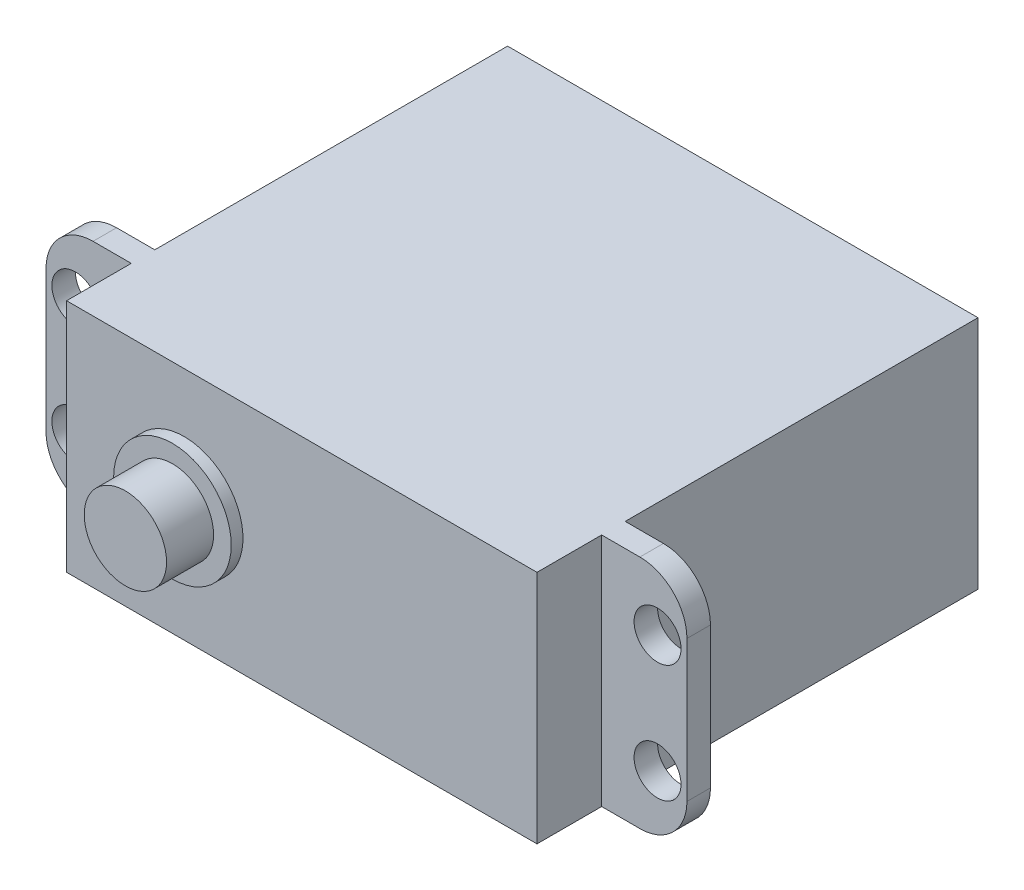
ISO-10303-21;
HEADER;
FILE_DESCRIPTION(('STEP AP214'),'2;1');
FILE_NAME('part.step','',(''),(''),'','','');
FILE_SCHEMA(('AUTOMOTIVE_DESIGN { 1 0 10303 214 1 1 1 1 }'));
ENDSEC;
DATA;
#1=APPLICATION_CONTEXT('core data for automotive mechanical design processes');
#2=APPLICATION_PROTOCOL_DEFINITION('international standard','automotive_design',2000,#1);
#3=PRODUCT_CONTEXT('',#1,'mechanical');
#4=PRODUCT('Part','Part','',(#3));
#5=PRODUCT_RELATED_PRODUCT_CATEGORY('part','',(#4));
#6=PRODUCT_DEFINITION_FORMATION('','',#4);
#7=PRODUCT_DEFINITION_CONTEXT('part definition',#1,'design');
#8=PRODUCT_DEFINITION('design','',#6,#7);
#9=PRODUCT_DEFINITION_SHAPE('','',#8);
#10=(LENGTH_UNIT() NAMED_UNIT(*) SI_UNIT(.MILLI.,.METRE.));
#11=(NAMED_UNIT(*) PLANE_ANGLE_UNIT() SI_UNIT($,.RADIAN.));
#12=(NAMED_UNIT(*) SI_UNIT($,.STERADIAN.) SOLID_ANGLE_UNIT());
#13=UNCERTAINTY_MEASURE_WITH_UNIT(LENGTH_MEASURE(1.E-05),#10,'distance_accuracy_value','');
#14=(GEOMETRIC_REPRESENTATION_CONTEXT(3) GLOBAL_UNCERTAINTY_ASSIGNED_CONTEXT((#13)) GLOBAL_UNIT_ASSIGNED_CONTEXT((#10,
#11,#12)) REPRESENTATION_CONTEXT('',''));
#15=CARTESIAN_POINT('',(0.,0.,0.));
#16=DIRECTION('',(0.,0.,1.));
#17=DIRECTION('',(1.,0.,0.));
#18=AXIS2_PLACEMENT_3D('',#15,#16,#17);
#19=CARTESIAN_POINT('',(-20.,-10.,37.5));
#20=DIRECTION('',(-1.,0.,0.));
#21=DIRECTION('',(0.,0.,1.));
#22=AXIS2_PLACEMENT_3D('',#19,#20,#21);
#23=PLANE('',#22);
#24=DIRECTION('',(0.,-1.,0.));
#25=VECTOR('',#24,1.);
#26=CARTESIAN_POINT('',(-20.,10.,30.));
#27=LINE('',#26,#25);
#28=CARTESIAN_POINT('',(-20.,10.,30.));
#29=VERTEX_POINT('',#28);
#30=CARTESIAN_POINT('',(-20.,-10.,30.));
#31=VERTEX_POINT('',#30);
#32=EDGE_CURVE('E190',#29,#31,#27,.T.);
#33=ORIENTED_EDGE('',*,*,#32,.F.);
#34=DIRECTION('',(0.,0.,-1.));
#35=VECTOR('',#34,1.);
#36=CARTESIAN_POINT('',(-20.,10.,37.5));
#37=LINE('',#36,#35);
#38=CARTESIAN_POINT('',(-20.,10.,0.));
#39=VERTEX_POINT('',#38);
#40=EDGE_CURVE('E185',#29,#39,#37,.T.);
#41=ORIENTED_EDGE('',*,*,#40,.T.);
#42=DIRECTION('',(0.,1.,0.));
#43=VECTOR('',#42,1.);
#44=CARTESIAN_POINT('',(-20.,-10.,0.));
#45=LINE('',#44,#43);
#46=CARTESIAN_POINT('',(-20.,-10.,0.));
#47=VERTEX_POINT('',#46);
#48=EDGE_CURVE('E248',#47,#39,#45,.T.);
#49=ORIENTED_EDGE('',*,*,#48,.F.);
#50=DIRECTION('',(0.,0.,-1.));
#51=VECTOR('',#50,1.);
#52=CARTESIAN_POINT('',(-20.,-10.,37.5));
#53=LINE('',#52,#51);
#54=EDGE_CURVE('E287',#31,#47,#53,.T.);
#55=ORIENTED_EDGE('',*,*,#54,.F.);
#56=EDGE_LOOP('',(#33,#41,#49,#55));
#57=FACE_BOUND('',#56,.T.);
#58=ADVANCED_FACE('F45',(#57),#23,.T.);
#59=CARTESIAN_POINT('',(20.,-10.,37.5));
#60=DIRECTION('',(-1.,0.,0.));
#61=DIRECTION('',(0.,0.,1.));
#62=AXIS2_PLACEMENT_3D('',#59,#60,#61);
#63=PLANE('',#62);
#64=DIRECTION('',(0.,0.,-1.));
#65=VECTOR('',#64,1.);
#66=CARTESIAN_POINT('',(20.,-10.,37.5));
#67=LINE('',#66,#65);
#68=CARTESIAN_POINT('',(20.,-10.,37.5));
#69=VERTEX_POINT('',#68);
#70=CARTESIAN_POINT('',(20.,-10.,32.));
#71=VERTEX_POINT('',#70);
#72=EDGE_CURVE('E288',#69,#71,#67,.T.);
#73=ORIENTED_EDGE('',*,*,#72,.T.);
#74=DIRECTION('',(0.,1.,0.));
#75=VECTOR('',#74,1.);
#76=CARTESIAN_POINT('',(20.,-10.,32.));
#77=LINE('',#76,#75);
#78=CARTESIAN_POINT('',(20.,10.,32.));
#79=VERTEX_POINT('',#78);
#80=EDGE_CURVE('E217',#71,#79,#77,.T.);
#81=ORIENTED_EDGE('',*,*,#80,.T.);
#82=DIRECTION('',(0.,0.,-1.));
#83=VECTOR('',#82,1.);
#84=CARTESIAN_POINT('',(20.,10.,37.5));
#85=LINE('',#84,#83);
#86=CARTESIAN_POINT('',(20.,10.,37.5));
#87=VERTEX_POINT('',#86);
#88=EDGE_CURVE('E293',#87,#79,#85,.T.);
#89=ORIENTED_EDGE('',*,*,#88,.F.);
#90=DIRECTION('',(0.,1.,0.));
#91=VECTOR('',#90,1.);
#92=CARTESIAN_POINT('',(20.,-10.,37.5));
#93=LINE('',#92,#91);
#94=EDGE_CURVE('E263',#69,#87,#93,.T.);
#95=ORIENTED_EDGE('',*,*,#94,.F.);
#96=EDGE_LOOP('',(#73,#81,#89,#95));
#97=FACE_BOUND('',#96,.T.);
#98=ADVANCED_FACE('F361',(#97),#63,.F.);
#99=DIRECTION('',(0.,1.,0.));
#100=VECTOR('',#99,1.);
#101=CARTESIAN_POINT('',(-20.,-10.,32.));
#102=LINE('',#101,#100);
#103=CARTESIAN_POINT('',(-20.,-10.,32.));
#104=VERTEX_POINT('',#103);
#105=CARTESIAN_POINT('',(-20.,10.,32.));
#106=VERTEX_POINT('',#105);
#107=EDGE_CURVE('E179',#104,#106,#102,.T.);
#108=ORIENTED_EDGE('',*,*,#107,.F.);
#109=CARTESIAN_POINT('',(-20.,-10.,37.5));
#110=VERTEX_POINT('',#109);
#111=EDGE_CURVE('E283',#110,#104,#53,.T.);
#112=ORIENTED_EDGE('',*,*,#111,.F.);
#113=DIRECTION('',(0.,1.,0.));
#114=VECTOR('',#113,1.);
#115=CARTESIAN_POINT('',(-20.,-10.,37.5));
#116=LINE('',#115,#114);
#117=CARTESIAN_POINT('',(-20.,10.,37.5));
#118=VERTEX_POINT('',#117);
#119=EDGE_CURVE('E182',#110,#118,#116,.T.);
#120=ORIENTED_EDGE('',*,*,#119,.T.);
#121=EDGE_CURVE('E164',#118,#106,#37,.T.);
#122=ORIENTED_EDGE('',*,*,#121,.T.);
#123=EDGE_LOOP('',(#108,#112,#120,#122));
#124=FACE_BOUND('',#123,.T.);
#125=ADVANCED_FACE('F178',(#124),#23,.T.);
#126=CARTESIAN_POINT('',(-20.,-10.,37.5));
#127=DIRECTION('',(0.,1.,0.));
#128=DIRECTION('',(0.,0.,1.));
#129=AXIS2_PLACEMENT_3D('',#126,#127,#128);
#130=PLANE('',#129);
#131=DIRECTION('',(1.,0.,0.));
#132=VECTOR('',#131,1.);
#133=CARTESIAN_POINT('',(-27.25,-10.,32.));
#134=LINE('',#133,#132);
#135=CARTESIAN_POINT('',(-23.25,-10.,32.));
#136=VERTEX_POINT('',#135);
#137=EDGE_CURVE('E172',#136,#104,#134,.T.);
#138=ORIENTED_EDGE('',*,*,#137,.F.);
#139=DIRECTION('',(0.,0.,1.));
#140=VECTOR('',#139,1.);
#141=CARTESIAN_POINT('',(-23.25,-10.,30.));
#142=LINE('',#141,#140);
#143=CARTESIAN_POINT('',(-23.25,-10.,30.));
#144=VERTEX_POINT('',#143);
#145=EDGE_CURVE('E70',#136,#144,#142,.F.);
#146=ORIENTED_EDGE('',*,*,#145,.T.);
#147=DIRECTION('',(1.,0.,0.));
#148=VECTOR('',#147,1.);
#149=CARTESIAN_POINT('',(-27.25,-10.,30.));
#150=LINE('',#149,#148);
#151=EDGE_CURVE('E205',#144,#31,#150,.T.);
#152=ORIENTED_EDGE('',*,*,#151,.T.);
#153=ORIENTED_EDGE('',*,*,#54,.T.);
#154=DIRECTION('',(1.,0.,0.));
#155=VECTOR('',#154,1.);
#156=CARTESIAN_POINT('',(-20.,-10.,0.));
#157=LINE('',#156,#155);
#158=CARTESIAN_POINT('',(20.,-10.,0.));
#159=VERTEX_POINT('',#158);
#160=EDGE_CURVE('E260',#47,#159,#157,.T.);
#161=ORIENTED_EDGE('',*,*,#160,.T.);
#162=CARTESIAN_POINT('',(20.,-10.,30.));
#163=VERTEX_POINT('',#162);
#164=EDGE_CURVE('E292',#163,#159,#67,.T.);
#165=ORIENTED_EDGE('',*,*,#164,.F.);
#166=DIRECTION('',(-1.,0.,0.));
#167=VECTOR('',#166,1.);
#168=CARTESIAN_POINT('',(27.25,-10.,30.));
#169=LINE('',#168,#167);
#170=CARTESIAN_POINT('',(23.25,-10.,30.));
#171=VERTEX_POINT('',#170);
#172=EDGE_CURVE('E245',#171,#163,#169,.T.);
#173=ORIENTED_EDGE('',*,*,#172,.F.);
#174=DIRECTION('',(0.,0.,1.));
#175=VECTOR('',#174,1.);
#176=CARTESIAN_POINT('',(23.25,-10.,37.5));
#177=LINE('',#176,#175);
#178=CARTESIAN_POINT('',(23.25,-10.,32.));
#179=VERTEX_POINT('',#178);
#180=EDGE_CURVE('E318',#171,#179,#177,.T.);
#181=ORIENTED_EDGE('',*,*,#180,.T.);
#182=DIRECTION('',(-1.,0.,0.));
#183=VECTOR('',#182,1.);
#184=CARTESIAN_POINT('',(27.25,-10.,32.));
#185=LINE('',#184,#183);
#186=EDGE_CURVE('E238',#179,#71,#185,.T.);
#187=ORIENTED_EDGE('',*,*,#186,.T.);
#188=ORIENTED_EDGE('',*,*,#72,.F.);
#189=DIRECTION('',(1.,0.,0.));
#190=VECTOR('',#189,1.);
#191=CARTESIAN_POINT('',(-20.,-10.,37.5));
#192=LINE('',#191,#190);
#193=EDGE_CURVE('E266',#110,#69,#192,.T.);
#194=ORIENTED_EDGE('',*,*,#193,.F.);
#195=ORIENTED_EDGE('',*,*,#111,.T.);
#196=EDGE_LOOP('',(#138,#146,#152,#153,#161,#165,#173,#181,#187,#188,#194,#195));
#197=FACE_BOUND('',#196,.T.);
#198=ADVANCED_FACE('F447',(#197),#130,.F.);
#199=CARTESIAN_POINT('',(20.,10.,30.));
#200=VERTEX_POINT('',#199);
#201=CARTESIAN_POINT('',(20.,10.,0.));
#202=VERTEX_POINT('',#201);
#203=EDGE_CURVE('E184',#200,#202,#85,.T.);
#204=ORIENTED_EDGE('',*,*,#203,.F.);
#205=DIRECTION('',(0.,-1.,0.));
#206=VECTOR('',#205,1.);
#207=CARTESIAN_POINT('',(20.,10.,30.));
#208=LINE('',#207,#206);
#209=EDGE_CURVE('E234',#200,#163,#208,.T.);
#210=ORIENTED_EDGE('',*,*,#209,.T.);
#211=ORIENTED_EDGE('',*,*,#164,.T.);
#212=DIRECTION('',(0.,1.,0.));
#213=VECTOR('',#212,1.);
#214=CARTESIAN_POINT('',(20.,-10.,0.));
#215=LINE('',#214,#213);
#216=EDGE_CURVE('E276',#159,#202,#215,.T.);
#217=ORIENTED_EDGE('',*,*,#216,.T.);
#218=EDGE_LOOP('',(#204,#210,#211,#217));
#219=FACE_BOUND('',#218,.T.);
#220=ADVANCED_FACE('F380',(#219),#63,.F.);
#221=CARTESIAN_POINT('',(-20.,10.,37.5));
#222=DIRECTION('',(0.,1.,0.));
#223=DIRECTION('',(0.,0.,1.));
#224=AXIS2_PLACEMENT_3D('',#221,#222,#223);
#225=PLANE('',#224);
#226=DIRECTION('',(1.,0.,0.));
#227=VECTOR('',#226,1.);
#228=CARTESIAN_POINT('',(-27.25,10.,30.));
#229=LINE('',#228,#227);
#230=CARTESIAN_POINT('',(-23.25,10.,30.));
#231=VERTEX_POINT('',#230);
#232=EDGE_CURVE('E173',#231,#29,#229,.T.);
#233=ORIENTED_EDGE('',*,*,#232,.F.);
#234=DIRECTION('',(0.,0.,-1.));
#235=VECTOR('',#234,1.);
#236=CARTESIAN_POINT('',(-23.25,10.,37.5));
#237=LINE('',#236,#235);
#238=CARTESIAN_POINT('',(-23.25,10.,32.));
#239=VERTEX_POINT('',#238);
#240=EDGE_CURVE('E167',#231,#239,#237,.F.);
#241=ORIENTED_EDGE('',*,*,#240,.T.);
#242=DIRECTION('',(1.,0.,0.));
#243=VECTOR('',#242,1.);
#244=CARTESIAN_POINT('',(-27.25,10.,32.));
#245=LINE('',#244,#243);
#246=EDGE_CURVE('E160',#239,#106,#245,.T.);
#247=ORIENTED_EDGE('',*,*,#246,.T.);
#248=ORIENTED_EDGE('',*,*,#121,.F.);
#249=DIRECTION('',(1.,0.,0.));
#250=VECTOR('',#249,1.);
#251=CARTESIAN_POINT('',(-20.,10.,37.5));
#252=LINE('',#251,#250);
#253=EDGE_CURVE('E259',#118,#87,#252,.T.);
#254=ORIENTED_EDGE('',*,*,#253,.T.);
#255=ORIENTED_EDGE('',*,*,#88,.T.);
#256=DIRECTION('',(-1.,0.,0.));
#257=VECTOR('',#256,1.);
#258=CARTESIAN_POINT('',(27.25,10.,32.));
#259=LINE('',#258,#257);
#260=CARTESIAN_POINT('',(23.25,10.,32.));
#261=VERTEX_POINT('',#260);
#262=EDGE_CURVE('E252',#261,#79,#259,.T.);
#263=ORIENTED_EDGE('',*,*,#262,.F.);
#264=DIRECTION('',(0.,0.,-1.));
#265=VECTOR('',#264,1.);
#266=CARTESIAN_POINT('',(23.25,10.,30.));
#267=LINE('',#266,#265);
#268=CARTESIAN_POINT('',(23.25,10.,30.));
#269=VERTEX_POINT('',#268);
#270=EDGE_CURVE('E286',#261,#269,#267,.T.);
#271=ORIENTED_EDGE('',*,*,#270,.T.);
#272=DIRECTION('',(-1.,0.,0.));
#273=VECTOR('',#272,1.);
#274=CARTESIAN_POINT('',(27.25,10.,30.));
#275=LINE('',#274,#273);
#276=EDGE_CURVE('E249',#269,#200,#275,.T.);
#277=ORIENTED_EDGE('',*,*,#276,.T.);
#278=ORIENTED_EDGE('',*,*,#203,.T.);
#279=DIRECTION('',(1.,0.,0.));
#280=VECTOR('',#279,1.);
#281=CARTESIAN_POINT('',(-20.,10.,0.));
#282=LINE('',#281,#280);
#283=EDGE_CURVE('E272',#39,#202,#282,.T.);
#284=ORIENTED_EDGE('',*,*,#283,.F.);
#285=ORIENTED_EDGE('',*,*,#40,.F.);
#286=EDGE_LOOP('',(#233,#241,#247,#248,#254,#255,#263,#271,#277,#278,#284,#285));
#287=FACE_BOUND('',#286,.T.);
#288=ADVANCED_FACE('F162',(#287),#225,.T.);
#289=CARTESIAN_POINT('',(0.,0.,37.5));
#290=DIRECTION('',(0.,0.,-1.));
#291=DIRECTION('',(-1.,0.,0.));
#292=AXIS2_PLACEMENT_3D('',#289,#290,#291);
#293=PLANE('',#292);
#294=CARTESIAN_POINT('',(-10.,0.,37.5));
#295=DIRECTION('',(0.,0.,-1.));
#296=DIRECTION('',(-1.,0.,0.));
#297=AXIS2_PLACEMENT_3D('',#294,#295,#296);
#298=CIRCLE('',#297,5.);
#299=CARTESIAN_POINT('',(-15.,0.,37.5));
#300=VERTEX_POINT('',#299);
#301=EDGE_CURVE('E49',#300,#300,#298,.F.);
#302=ORIENTED_EDGE('',*,*,#301,.F.);
#303=EDGE_LOOP('',(#302));
#304=FACE_BOUND('',#303,.T.);
#305=ORIENTED_EDGE('',*,*,#119,.F.);
#306=ORIENTED_EDGE('',*,*,#193,.T.);
#307=ORIENTED_EDGE('',*,*,#94,.T.);
#308=ORIENTED_EDGE('',*,*,#253,.F.);
#309=EDGE_LOOP('',(#305,#306,#307,#308));
#310=FACE_BOUND('',#309,.T.);
#311=ADVANCED_FACE('F349',(#304,#310),#293,.F.);
#312=CARTESIAN_POINT('',(0.,0.,0.));
#313=DIRECTION('',(0.,0.,-1.));
#314=DIRECTION('',(-1.,0.,0.));
#315=AXIS2_PLACEMENT_3D('',#312,#313,#314);
#316=PLANE('',#315);
#317=ORIENTED_EDGE('',*,*,#48,.T.);
#318=ORIENTED_EDGE('',*,*,#283,.T.);
#319=ORIENTED_EDGE('',*,*,#216,.F.);
#320=ORIENTED_EDGE('',*,*,#160,.F.);
#321=EDGE_LOOP('',(#317,#318,#319,#320));
#322=FACE_BOUND('',#321,.T.);
#323=ADVANCED_FACE('F352',(#322),#316,.T.);
#324=CARTESIAN_POINT('',(27.25,10.,30.));
#325=DIRECTION('',(0.,0.,-1.));
#326=DIRECTION('',(0.,1.,0.));
#327=AXIS2_PLACEMENT_3D('',#324,#325,#326);
#328=PLANE('',#327);
#329=CARTESIAN_POINT('',(24.75,4.99942998703595,30.));
#330=DIRECTION('',(0.,0.,1.));
#331=DIRECTION('',(1.,0.,0.));
#332=AXIS2_PLACEMENT_3D('',#329,#330,#331);
#333=CIRCLE('',#332,1.99547319519888);
#334=CARTESIAN_POINT('',(26.7454731951989,4.99942998703595,30.));
#335=VERTEX_POINT('',#334);
#336=EDGE_CURVE('E213',#335,#335,#333,.T.);
#337=ORIENTED_EDGE('',*,*,#336,.T.);
#338=EDGE_LOOP('',(#337));
#339=FACE_BOUND('',#338,.T.);
#340=CARTESIAN_POINT('',(24.75,-4.99913934048573,30.));
#341=DIRECTION('',(0.,0.,1.));
#342=DIRECTION('',(1.,0.,0.));
#343=AXIS2_PLACEMENT_3D('',#340,#341,#342);
#344=CIRCLE('',#343,1.99547319519888);
#345=CARTESIAN_POINT('',(26.7454731951989,-4.99913934048573,30.));
#346=VERTEX_POINT('',#345);
#347=EDGE_CURVE('E212',#346,#346,#344,.T.);
#348=ORIENTED_EDGE('',*,*,#347,.T.);
#349=EDGE_LOOP('',(#348));
#350=FACE_BOUND('',#349,.T.);
#351=ORIENTED_EDGE('',*,*,#276,.F.);
#352=CARTESIAN_POINT('',(23.25,6.,30.));
#353=DIRECTION('',(0.,0.,-1.));
#354=DIRECTION('',(0.,1.,0.));
#355=AXIS2_PLACEMENT_3D('',#352,#353,#354);
#356=CIRCLE('',#355,4.);
#357=CARTESIAN_POINT('',(27.25,6.,30.));
#358=VERTEX_POINT('',#357);
#359=EDGE_CURVE('E303',#269,#358,#356,.T.);
#360=ORIENTED_EDGE('',*,*,#359,.T.);
#361=DIRECTION('',(0.,-1.,0.));
#362=VECTOR('',#361,1.);
#363=CARTESIAN_POINT('',(27.25,10.,30.));
#364=LINE('',#363,#362);
#365=CARTESIAN_POINT('',(27.25,-6.,30.));
#366=VERTEX_POINT('',#365);
#367=EDGE_CURVE('E233',#358,#366,#364,.T.);
#368=ORIENTED_EDGE('',*,*,#367,.T.);
#369=CARTESIAN_POINT('',(23.25,-6.,30.));
#370=DIRECTION('',(0.,0.,-1.));
#371=DIRECTION('',(0.,1.,0.));
#372=AXIS2_PLACEMENT_3D('',#369,#370,#371);
#373=CIRCLE('',#372,4.);
#374=EDGE_CURVE('E300',#366,#171,#373,.T.);
#375=ORIENTED_EDGE('',*,*,#374,.T.);
#376=ORIENTED_EDGE('',*,*,#172,.T.);
#377=ORIENTED_EDGE('',*,*,#209,.F.);
#378=EDGE_LOOP('',(#351,#360,#368,#375,#376,#377));
#379=FACE_BOUND('',#378,.T.);
#380=ADVANCED_FACE('F374',(#339,#350,#379),#328,.T.);
#381=CARTESIAN_POINT('',(27.25,-10.,32.));
#382=DIRECTION('',(0.,0.,1.));
#383=DIRECTION('',(1.,0.,0.));
#384=AXIS2_PLACEMENT_3D('',#381,#382,#383);
#385=PLANE('',#384);
#386=CARTESIAN_POINT('',(24.75,4.99942998703595,32.));
#387=DIRECTION('',(0.,0.,1.));
#388=DIRECTION('',(1.,0.,0.));
#389=AXIS2_PLACEMENT_3D('',#386,#387,#388);
#390=CIRCLE('',#389,1.99547319519888);
#391=CARTESIAN_POINT('',(26.7454731951989,4.99942998703595,32.));
#392=VERTEX_POINT('',#391);
#393=EDGE_CURVE('E218',#392,#392,#390,.T.);
#394=ORIENTED_EDGE('',*,*,#393,.F.);
#395=EDGE_LOOP('',(#394));
#396=FACE_BOUND('',#395,.T.);
#397=CARTESIAN_POINT('',(24.75,-4.99913934048573,32.));
#398=DIRECTION('',(0.,0.,1.));
#399=DIRECTION('',(1.,0.,0.));
#400=AXIS2_PLACEMENT_3D('',#397,#398,#399);
#401=CIRCLE('',#400,1.99547319519888);
#402=CARTESIAN_POINT('',(26.7454731951989,-4.99913934048573,32.));
#403=VERTEX_POINT('',#402);
#404=EDGE_CURVE('E222',#403,#403,#401,.T.);
#405=ORIENTED_EDGE('',*,*,#404,.F.);
#406=EDGE_LOOP('',(#405));
#407=FACE_BOUND('',#406,.T.);
#408=DIRECTION('',(0.,1.,0.));
#409=VECTOR('',#408,1.);
#410=CARTESIAN_POINT('',(27.25,-10.,32.));
#411=LINE('',#410,#409);
#412=CARTESIAN_POINT('',(27.25,-6.,32.));
#413=VERTEX_POINT('',#412);
#414=CARTESIAN_POINT('',(27.25,6.,32.));
#415=VERTEX_POINT('',#414);
#416=EDGE_CURVE('E229',#413,#415,#411,.T.);
#417=ORIENTED_EDGE('',*,*,#416,.T.);
#418=CARTESIAN_POINT('',(23.25,6.,32.));
#419=DIRECTION('',(0.,0.,1.));
#420=DIRECTION('',(1.,0.,0.));
#421=AXIS2_PLACEMENT_3D('',#418,#419,#420);
#422=CIRCLE('',#421,4.);
#423=EDGE_CURVE('E315',#415,#261,#422,.T.);
#424=ORIENTED_EDGE('',*,*,#423,.T.);
#425=ORIENTED_EDGE('',*,*,#262,.T.);
#426=ORIENTED_EDGE('',*,*,#80,.F.);
#427=ORIENTED_EDGE('',*,*,#186,.F.);
#428=CARTESIAN_POINT('',(23.25,-6.,32.));
#429=DIRECTION('',(0.,0.,1.));
#430=DIRECTION('',(1.,0.,0.));
#431=AXIS2_PLACEMENT_3D('',#428,#429,#430);
#432=CIRCLE('',#431,4.);
#433=EDGE_CURVE('E312',#179,#413,#432,.T.);
#434=ORIENTED_EDGE('',*,*,#433,.T.);
#435=EDGE_LOOP('',(#417,#424,#425,#426,#427,#434));
#436=FACE_BOUND('',#435,.T.);
#437=ADVANCED_FACE('F365',(#396,#407,#436),#385,.T.);
#438=CARTESIAN_POINT('',(27.25,0.,0.));
#439=DIRECTION('',(-1.,0.,0.));
#440=DIRECTION('',(0.,0.,1.));
#441=AXIS2_PLACEMENT_3D('',#438,#439,#440);
#442=PLANE('',#441);
#443=ORIENTED_EDGE('',*,*,#367,.F.);
#444=DIRECTION('',(0.,0.,-1.));
#445=VECTOR('',#444,1.);
#446=CARTESIAN_POINT('',(27.25,6.,32.));
#447=LINE('',#446,#445);
#448=EDGE_CURVE('E309',#358,#415,#447,.F.);
#449=ORIENTED_EDGE('',*,*,#448,.T.);
#450=ORIENTED_EDGE('',*,*,#416,.F.);
#451=DIRECTION('',(0.,0.,1.));
#452=VECTOR('',#451,1.);
#453=CARTESIAN_POINT('',(27.25,-6.,0.));
#454=LINE('',#453,#452);
#455=EDGE_CURVE('E306',#413,#366,#454,.F.);
#456=ORIENTED_EDGE('',*,*,#455,.T.);
#457=EDGE_LOOP('',(#443,#449,#450,#456));
#458=FACE_BOUND('',#457,.T.);
#459=ADVANCED_FACE('F558',(#458),#442,.F.);
#460=CARTESIAN_POINT('',(24.75,-4.99913934048573,30.));
#461=DIRECTION('',(0.,0.,1.));
#462=DIRECTION('',(1.,0.,0.));
#463=AXIS2_PLACEMENT_3D('',#460,#461,#462);
#464=CYLINDRICAL_SURFACE('',#463,1.99547319519888);
#465=ORIENTED_EDGE('',*,*,#347,.F.);
#466=EDGE_LOOP('',(#465));
#467=FACE_BOUND('',#466,.T.);
#468=ORIENTED_EDGE('',*,*,#404,.T.);
#469=EDGE_LOOP('',(#468));
#470=FACE_BOUND('',#469,.T.);
#471=ADVANCED_FACE('F568',(#467,#470),#464,.F.);
#472=CARTESIAN_POINT('',(24.75,4.99942998703595,30.));
#473=DIRECTION('',(0.,0.,1.));
#474=DIRECTION('',(1.,0.,0.));
#475=AXIS2_PLACEMENT_3D('',#472,#473,#474);
#476=CYLINDRICAL_SURFACE('',#475,1.99547319519888);
#477=ORIENTED_EDGE('',*,*,#336,.F.);
#478=EDGE_LOOP('',(#477));
#479=FACE_BOUND('',#478,.T.);
#480=ORIENTED_EDGE('',*,*,#393,.T.);
#481=EDGE_LOOP('',(#480));
#482=FACE_BOUND('',#481,.T.);
#483=ADVANCED_FACE('F579',(#479,#482),#476,.F.);
#484=CARTESIAN_POINT('',(23.25,6.,37.5));
#485=DIRECTION('',(0.,0.,1.));
#486=DIRECTION('',(1.,0.,0.));
#487=AXIS2_PLACEMENT_3D('',#484,#485,#486);
#488=CYLINDRICAL_SURFACE('',#487,4.);
#489=ORIENTED_EDGE('',*,*,#423,.F.);
#490=ORIENTED_EDGE('',*,*,#448,.F.);
#491=ORIENTED_EDGE('',*,*,#359,.F.);
#492=ORIENTED_EDGE('',*,*,#270,.F.);
#493=EDGE_LOOP('',(#489,#490,#491,#492));
#494=FACE_BOUND('',#493,.T.);
#495=ADVANCED_FACE('F370',(#494),#488,.T.);
#496=CARTESIAN_POINT('',(23.25,-6.,37.5));
#497=DIRECTION('',(0.,0.,1.));
#498=DIRECTION('',(1.,0.,0.));
#499=AXIS2_PLACEMENT_3D('',#496,#497,#498);
#500=CYLINDRICAL_SURFACE('',#499,4.);
#501=ORIENTED_EDGE('',*,*,#374,.F.);
#502=ORIENTED_EDGE('',*,*,#455,.F.);
#503=ORIENTED_EDGE('',*,*,#433,.F.);
#504=ORIENTED_EDGE('',*,*,#180,.F.);
#505=EDGE_LOOP('',(#501,#502,#503,#504));
#506=FACE_BOUND('',#505,.T.);
#507=ADVANCED_FACE('F469',(#506),#500,.T.);
#508=CARTESIAN_POINT('',(-27.25,-10.,32.));
#509=DIRECTION('',(0.,0.,-1.));
#510=DIRECTION('',(-1.,0.,0.));
#511=AXIS2_PLACEMENT_3D('',#508,#509,#510);
#512=PLANE('',#511);
#513=CARTESIAN_POINT('',(-24.75,5.,32.));
#514=DIRECTION('',(0.,0.,1.));
#515=DIRECTION('',(1.,0.,0.));
#516=AXIS2_PLACEMENT_3D('',#513,#514,#515);
#517=CIRCLE('',#516,2.);
#518=CARTESIAN_POINT('',(-22.75,5.,32.));
#519=VERTEX_POINT('',#518);
#520=EDGE_CURVE('E199',#519,#519,#517,.T.);
#521=ORIENTED_EDGE('',*,*,#520,.F.);
#522=EDGE_LOOP('',(#521));
#523=FACE_BOUND('',#522,.T.);
#524=CARTESIAN_POINT('',(-24.75,-5.,32.));
#525=DIRECTION('',(0.,0.,1.));
#526=DIRECTION('',(1.,0.,0.));
#527=AXIS2_PLACEMENT_3D('',#524,#525,#526);
#528=CIRCLE('',#527,2.);
#529=CARTESIAN_POINT('',(-22.75,-5.,32.));
#530=VERTEX_POINT('',#529);
#531=EDGE_CURVE('E397',#530,#530,#528,.T.);
#532=ORIENTED_EDGE('',*,*,#531,.F.);
#533=EDGE_LOOP('',(#532));
#534=FACE_BOUND('',#533,.T.);
#535=DIRECTION('',(0.,1.,0.));
#536=VECTOR('',#535,1.);
#537=CARTESIAN_POINT('',(-27.25,-10.,32.));
#538=LINE('',#537,#536);
#539=CARTESIAN_POINT('',(-27.25,-6.,32.));
#540=VERTEX_POINT('',#539);
#541=CARTESIAN_POINT('',(-27.25,6.,32.));
#542=VERTEX_POINT('',#541);
#543=EDGE_CURVE('E196',#540,#542,#538,.T.);
#544=ORIENTED_EDGE('',*,*,#543,.F.);
#545=CARTESIAN_POINT('',(-23.25,-6.,32.));
#546=DIRECTION('',(0.,0.,-1.));
#547=DIRECTION('',(-1.,0.,0.));
#548=AXIS2_PLACEMENT_3D('',#545,#546,#547);
#549=CIRCLE('',#548,4.);
#550=EDGE_CURVE('E333',#540,#136,#549,.F.);
#551=ORIENTED_EDGE('',*,*,#550,.T.);
#552=ORIENTED_EDGE('',*,*,#137,.T.);
#553=ORIENTED_EDGE('',*,*,#107,.T.);
#554=ORIENTED_EDGE('',*,*,#246,.F.);
#555=CARTESIAN_POINT('',(-23.25,6.,32.));
#556=DIRECTION('',(0.,0.,-1.));
#557=DIRECTION('',(-1.,0.,0.));
#558=AXIS2_PLACEMENT_3D('',#555,#556,#557);
#559=CIRCLE('',#558,4.);
#560=EDGE_CURVE('E330',#239,#542,#559,.F.);
#561=ORIENTED_EDGE('',*,*,#560,.T.);
#562=EDGE_LOOP('',(#544,#551,#552,#553,#554,#561));
#563=FACE_BOUND('',#562,.T.);
#564=ADVANCED_FACE('F188',(#523,#534,#563),#512,.F.);
#565=CARTESIAN_POINT('',(-27.25,10.,30.));
#566=DIRECTION('',(0.,0.,1.));
#567=DIRECTION('',(0.,-1.,0.));
#568=AXIS2_PLACEMENT_3D('',#565,#566,#567);
#569=PLANE('',#568);
#570=CARTESIAN_POINT('',(-24.75,5.,30.));
#571=DIRECTION('',(0.,0.,1.));
#572=DIRECTION('',(1.,0.,0.));
#573=AXIS2_PLACEMENT_3D('',#570,#571,#572);
#574=CIRCLE('',#573,2.);
#575=CARTESIAN_POINT('',(-22.75,5.,30.));
#576=VERTEX_POINT('',#575);
#577=EDGE_CURVE('E191',#576,#576,#574,.T.);
#578=ORIENTED_EDGE('',*,*,#577,.T.);
#579=EDGE_LOOP('',(#578));
#580=FACE_BOUND('',#579,.T.);
#581=CARTESIAN_POINT('',(-24.75,-5.,30.));
#582=DIRECTION('',(0.,0.,1.));
#583=DIRECTION('',(1.,0.,0.));
#584=AXIS2_PLACEMENT_3D('',#581,#582,#583);
#585=CIRCLE('',#584,2.);
#586=CARTESIAN_POINT('',(-22.75,-5.,30.));
#587=VERTEX_POINT('',#586);
#588=EDGE_CURVE('E393',#587,#587,#585,.T.);
#589=ORIENTED_EDGE('',*,*,#588,.T.);
#590=EDGE_LOOP('',(#589));
#591=FACE_BOUND('',#590,.T.);
#592=ORIENTED_EDGE('',*,*,#151,.F.);
#593=CARTESIAN_POINT('',(-23.25,-6.,30.));
#594=DIRECTION('',(0.,0.,1.));
#595=DIRECTION('',(0.,-1.,0.));
#596=AXIS2_PLACEMENT_3D('',#593,#594,#595);
#597=CIRCLE('',#596,4.);
#598=CARTESIAN_POINT('',(-27.25,-6.,30.));
#599=VERTEX_POINT('',#598);
#600=EDGE_CURVE('E340',#144,#599,#597,.F.);
#601=ORIENTED_EDGE('',*,*,#600,.T.);
#602=DIRECTION('',(0.,-1.,0.));
#603=VECTOR('',#602,1.);
#604=CARTESIAN_POINT('',(-27.25,10.,30.));
#605=LINE('',#604,#603);
#606=CARTESIAN_POINT('',(-27.25,6.,30.));
#607=VERTEX_POINT('',#606);
#608=EDGE_CURVE('E202',#607,#599,#605,.T.);
#609=ORIENTED_EDGE('',*,*,#608,.F.);
#610=CARTESIAN_POINT('',(-23.25,6.,30.));
#611=DIRECTION('',(0.,0.,1.));
#612=DIRECTION('',(0.,-1.,0.));
#613=AXIS2_PLACEMENT_3D('',#610,#611,#612);
#614=CIRCLE('',#613,4.);
#615=EDGE_CURVE('E62',#607,#231,#614,.F.);
#616=ORIENTED_EDGE('',*,*,#615,.T.);
#617=ORIENTED_EDGE('',*,*,#232,.T.);
#618=ORIENTED_EDGE('',*,*,#32,.T.);
#619=EDGE_LOOP('',(#592,#601,#609,#616,#617,#618));
#620=FACE_BOUND('',#619,.T.);
#621=ADVANCED_FACE('F468',(#580,#591,#620),#569,.F.);
#622=CARTESIAN_POINT('',(-27.25,0.,0.));
#623=DIRECTION('',(-1.,0.,0.));
#624=DIRECTION('',(0.,0.,1.));
#625=AXIS2_PLACEMENT_3D('',#622,#623,#624);
#626=PLANE('',#625);
#627=ORIENTED_EDGE('',*,*,#608,.T.);
#628=DIRECTION('',(0.,0.,1.));
#629=VECTOR('',#628,1.);
#630=CARTESIAN_POINT('',(-27.25,-6.,32.));
#631=LINE('',#630,#629);
#632=EDGE_CURVE('E326',#599,#540,#631,.T.);
#633=ORIENTED_EDGE('',*,*,#632,.T.);
#634=ORIENTED_EDGE('',*,*,#543,.T.);
#635=DIRECTION('',(0.,0.,-1.));
#636=VECTOR('',#635,1.);
#637=CARTESIAN_POINT('',(-27.25,6.,0.));
#638=LINE('',#637,#636);
#639=EDGE_CURVE('E322',#542,#607,#638,.T.);
#640=ORIENTED_EDGE('',*,*,#639,.T.);
#641=EDGE_LOOP('',(#627,#633,#634,#640));
#642=FACE_BOUND('',#641,.T.);
#643=ADVANCED_FACE('F478',(#642),#626,.T.);
#644=CARTESIAN_POINT('',(-24.75,-5.,30.));
#645=DIRECTION('',(0.,0.,1.));
#646=DIRECTION('',(1.,0.,0.));
#647=AXIS2_PLACEMENT_3D('',#644,#645,#646);
#648=CYLINDRICAL_SURFACE('',#647,2.);
#649=ORIENTED_EDGE('',*,*,#588,.F.);
#650=EDGE_LOOP('',(#649));
#651=FACE_BOUND('',#650,.T.);
#652=ORIENTED_EDGE('',*,*,#531,.T.);
#653=EDGE_LOOP('',(#652));
#654=FACE_BOUND('',#653,.T.);
#655=ADVANCED_FACE('F487',(#651,#654),#648,.F.);
#656=CARTESIAN_POINT('',(-24.75,5.,30.));
#657=DIRECTION('',(0.,0.,1.));
#658=DIRECTION('',(1.,0.,0.));
#659=AXIS2_PLACEMENT_3D('',#656,#657,#658);
#660=CYLINDRICAL_SURFACE('',#659,2.);
#661=ORIENTED_EDGE('',*,*,#577,.F.);
#662=EDGE_LOOP('',(#661));
#663=FACE_BOUND('',#662,.T.);
#664=ORIENTED_EDGE('',*,*,#520,.T.);
#665=EDGE_LOOP('',(#664));
#666=FACE_BOUND('',#665,.T.);
#667=ADVANCED_FACE('F495',(#663,#666),#660,.F.);
#668=CARTESIAN_POINT('',(-23.25,-6.,0.));
#669=DIRECTION('',(0.,0.,-1.));
#670=DIRECTION('',(-1.,0.,0.));
#671=AXIS2_PLACEMENT_3D('',#668,#669,#670);
#672=CYLINDRICAL_SURFACE('',#671,4.);
#673=ORIENTED_EDGE('',*,*,#600,.F.);
#674=ORIENTED_EDGE('',*,*,#145,.F.);
#675=ORIENTED_EDGE('',*,*,#550,.F.);
#676=ORIENTED_EDGE('',*,*,#632,.F.);
#677=EDGE_LOOP('',(#673,#674,#675,#676));
#678=FACE_BOUND('',#677,.T.);
#679=ADVANCED_FACE('F432',(#678),#672,.T.);
#680=CARTESIAN_POINT('',(-23.25,6.,0.));
#681=DIRECTION('',(0.,0.,-1.));
#682=DIRECTION('',(-1.,0.,0.));
#683=AXIS2_PLACEMENT_3D('',#680,#681,#682);
#684=CYLINDRICAL_SURFACE('',#683,4.);
#685=ORIENTED_EDGE('',*,*,#560,.F.);
#686=ORIENTED_EDGE('',*,*,#240,.F.);
#687=ORIENTED_EDGE('',*,*,#615,.F.);
#688=ORIENTED_EDGE('',*,*,#639,.F.);
#689=EDGE_LOOP('',(#685,#686,#687,#688));
#690=FACE_BOUND('',#689,.T.);
#691=ADVANCED_FACE('F47',(#690),#684,.T.);
#692=CARTESIAN_POINT('',(-10.,0.,38.5));
#693=DIRECTION('',(0.,0.,-1.));
#694=DIRECTION('',(-1.,0.,0.));
#695=AXIS2_PLACEMENT_3D('',#692,#693,#694);
#696=CYLINDRICAL_SURFACE('',#695,5.);
#697=CARTESIAN_POINT('',(-10.,0.,38.5));
#698=DIRECTION('',(0.,0.,1.));
#699=DIRECTION('',(1.,0.,0.));
#700=AXIS2_PLACEMENT_3D('',#697,#698,#699);
#701=CIRCLE('',#700,5.);
#702=CARTESIAN_POINT('',(-5.,0.,38.5));
#703=VERTEX_POINT('',#702);
#704=EDGE_CURVE('E398',#703,#703,#701,.T.);
#705=ORIENTED_EDGE('',*,*,#704,.F.);
#706=EDGE_LOOP('',(#705));
#707=FACE_BOUND('',#706,.T.);
#708=ORIENTED_EDGE('',*,*,#301,.T.);
#709=EDGE_LOOP('',(#708));
#710=FACE_BOUND('',#709,.T.);
#711=ADVANCED_FACE('F347',(#707,#710),#696,.T.);
#712=CARTESIAN_POINT('',(-10.,0.,38.5));
#713=DIRECTION('',(0.,0.,1.));
#714=DIRECTION('',(1.,0.,0.));
#715=AXIS2_PLACEMENT_3D('',#712,#713,#714);
#716=PLANE('',#715);
#717=CARTESIAN_POINT('',(-10.,0.,38.5));
#718=DIRECTION('',(0.,0.,1.));
#719=DIRECTION('',(1.,0.,0.));
#720=AXIS2_PLACEMENT_3D('',#717,#718,#719);
#721=CIRCLE('',#720,3.5);
#722=CARTESIAN_POINT('',(-6.5,0.,38.5));
#723=VERTEX_POINT('',#722);
#724=EDGE_CURVE('E11',#723,#723,#721,.T.);
#725=ORIENTED_EDGE('',*,*,#724,.F.);
#726=EDGE_LOOP('',(#725));
#727=FACE_BOUND('',#726,.T.);
#728=ORIENTED_EDGE('',*,*,#704,.T.);
#729=EDGE_LOOP('',(#728));
#730=FACE_BOUND('',#729,.T.);
#731=ADVANCED_FACE('F418',(#727,#730),#716,.T.);
#732=CARTESIAN_POINT('',(-10.,0.,42.5));
#733=DIRECTION('',(0.,0.,-1.));
#734=DIRECTION('',(-1.,0.,0.));
#735=AXIS2_PLACEMENT_3D('',#732,#733,#734);
#736=CYLINDRICAL_SURFACE('',#735,3.5);
#737=CARTESIAN_POINT('',(-10.,0.,42.5));
#738=DIRECTION('',(0.,0.,1.));
#739=DIRECTION('',(1.,0.,0.));
#740=AXIS2_PLACEMENT_3D('',#737,#738,#739);
#741=CIRCLE('',#740,3.5);
#742=CARTESIAN_POINT('',(-6.5,0.,42.5));
#743=VERTEX_POINT('',#742);
#744=EDGE_CURVE('E407',#743,#743,#741,.T.);
#745=ORIENTED_EDGE('',*,*,#744,.F.);
#746=EDGE_LOOP('',(#745));
#747=FACE_BOUND('',#746,.T.);
#748=ORIENTED_EDGE('',*,*,#724,.T.);
#749=EDGE_LOOP('',(#748));
#750=FACE_BOUND('',#749,.T.);
#751=ADVANCED_FACE('F415',(#747,#750),#736,.T.);
#752=CARTESIAN_POINT('',(-10.,0.,42.5));
#753=DIRECTION('',(0.,0.,1.));
#754=DIRECTION('',(1.,0.,0.));
#755=AXIS2_PLACEMENT_3D('',#752,#753,#754);
#756=PLANE('',#755);
#757=ORIENTED_EDGE('',*,*,#744,.T.);
#758=EDGE_LOOP('',(#757));
#759=FACE_BOUND('',#758,.T.);
#760=ADVANCED_FACE('F413',(#759),#756,.T.);
#761=CLOSED_SHELL('',(#58,#98,#125,#198,#220,#288,#311,#323,#380,#437,#459,#471,#483,#495,#507,
#564,#621,#643,#655,#667,#679,#691,#711,#731,#751,#760));
#762=MANIFOLD_SOLID_BREP('B2',#761);
#763=ADVANCED_BREP_SHAPE_REPRESENTATION('',(#18,#762),#14);
#764=SHAPE_DEFINITION_REPRESENTATION(#9,#763);
ENDSEC;
END-ISO-10303-21;
